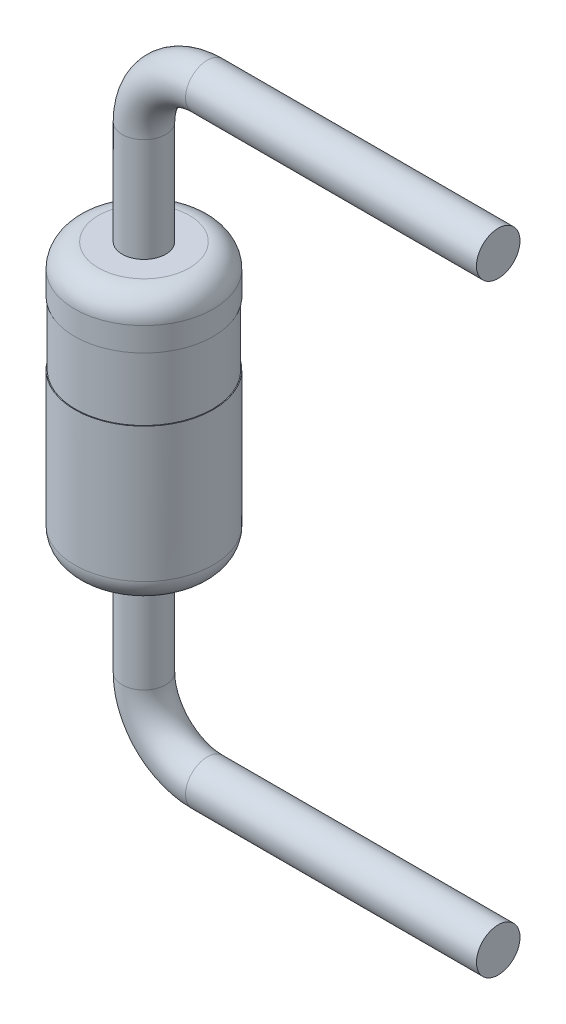
ISO-10303-21;
HEADER;
FILE_DESCRIPTION(('STEP AP214'),'2;1');
FILE_NAME('part.step','',(''),(''),'','','');
FILE_SCHEMA(('AUTOMOTIVE_DESIGN { 1 0 10303 214 1 1 1 1 }'));
ENDSEC;
DATA;
#1=APPLICATION_CONTEXT('core data for automotive mechanical design processes');
#2=APPLICATION_PROTOCOL_DEFINITION('international standard','automotive_design',2000,#1);
#3=PRODUCT_CONTEXT('',#1,'mechanical');
#4=PRODUCT('Part','Part','',(#3));
#5=PRODUCT_RELATED_PRODUCT_CATEGORY('part','',(#4));
#6=PRODUCT_DEFINITION_FORMATION('','',#4);
#7=PRODUCT_DEFINITION_CONTEXT('part definition',#1,'design');
#8=PRODUCT_DEFINITION('design','',#6,#7);
#9=PRODUCT_DEFINITION_SHAPE('','',#8);
#10=(LENGTH_UNIT() NAMED_UNIT(*) SI_UNIT(.MILLI.,.METRE.));
#11=(NAMED_UNIT(*) PLANE_ANGLE_UNIT() SI_UNIT($,.RADIAN.));
#12=(NAMED_UNIT(*) SI_UNIT($,.STERADIAN.) SOLID_ANGLE_UNIT());
#13=UNCERTAINTY_MEASURE_WITH_UNIT(LENGTH_MEASURE(1.E-05),#10,'distance_accuracy_value','');
#14=(GEOMETRIC_REPRESENTATION_CONTEXT(3) GLOBAL_UNCERTAINTY_ASSIGNED_CONTEXT((#13)) GLOBAL_UNIT_ASSIGNED_CONTEXT((#10,
#11,#12)) REPRESENTATION_CONTEXT('',''));
#15=CARTESIAN_POINT('',(0.,0.,0.));
#16=DIRECTION('',(0.,0.,1.));
#17=DIRECTION('',(1.,0.,0.));
#18=AXIS2_PLACEMENT_3D('',#15,#16,#17);
#19=CARTESIAN_POINT('',(0.,1.7,0.));
#20=DIRECTION('',(0.,1.,0.));
#21=DIRECTION('',(-1.,0.,0.));
#22=AXIS2_PLACEMENT_3D('',#19,#20,#21);
#23=CYLINDRICAL_SURFACE('',#22,0.875);
#24=CARTESIAN_POINT('',(0.,-1.4,0.));
#25=DIRECTION('',(0.,1.,0.));
#26=DIRECTION('',(-1.,0.,0.));
#27=AXIS2_PLACEMENT_3D('',#24,#25,#26);
#28=CIRCLE('',#27,0.875);
#29=CARTESIAN_POINT('',(-0.875,-1.4,0.));
#30=VERTEX_POINT('',#29);
#31=EDGE_CURVE('E45',#30,#30,#28,.T.);
#32=ORIENTED_EDGE('',*,*,#31,.T.);
#33=EDGE_LOOP('',(#32));
#34=FACE_BOUND('',#33,.T.);
#35=CARTESIAN_POINT('',(0.,0.3,0.));
#36=DIRECTION('',(0.,-1.,0.));
#37=DIRECTION('',(1.,0.,0.));
#38=AXIS2_PLACEMENT_3D('',#35,#36,#37);
#39=CIRCLE('',#38,0.875);
#40=CARTESIAN_POINT('',(0.875,0.3,0.));
#41=VERTEX_POINT('',#40);
#42=EDGE_CURVE('E129',#41,#41,#39,.T.);
#43=ORIENTED_EDGE('',*,*,#42,.T.);
#44=EDGE_LOOP('',(#43));
#45=FACE_BOUND('',#44,.T.);
#46=ADVANCED_FACE('F37',(#34,#45),#23,.T.);
#47=CARTESIAN_POINT('',(0.875,-1.7,0.));
#48=DIRECTION('',(0.,1.,0.));
#49=DIRECTION('',(1.,0.,0.));
#50=AXIS2_PLACEMENT_3D('',#47,#48,#49);
#51=PLANE('',#50);
#52=CARTESIAN_POINT('',(0.,-1.7,0.));
#53=DIRECTION('',(0.,1.,0.));
#54=DIRECTION('',(-1.,0.,0.));
#55=AXIS2_PLACEMENT_3D('',#52,#53,#54);
#56=CIRCLE('',#55,0.275);
#57=CARTESIAN_POINT('',(-0.275,-1.7,0.));
#58=VERTEX_POINT('',#57);
#59=EDGE_CURVE('E132',#58,#58,#56,.F.);
#60=ORIENTED_EDGE('',*,*,#59,.F.);
#61=EDGE_LOOP('',(#60));
#62=FACE_BOUND('',#61,.T.);
#63=CARTESIAN_POINT('',(0.,-1.7,0.));
#64=DIRECTION('',(0.,1.,0.));
#65=DIRECTION('',(-1.,0.,0.));
#66=AXIS2_PLACEMENT_3D('',#63,#64,#65);
#67=CIRCLE('',#66,0.575);
#68=CARTESIAN_POINT('',(-0.575,-1.7,0.));
#69=VERTEX_POINT('',#68);
#70=EDGE_CURVE('E11',#69,#69,#67,.F.);
#71=ORIENTED_EDGE('',*,*,#70,.T.);
#72=EDGE_LOOP('',(#71));
#73=FACE_BOUND('',#72,.T.);
#74=ADVANCED_FACE('F85',(#62,#73),#51,.F.);
#75=CARTESIAN_POINT('',(0.,-1.4,0.));
#76=DIRECTION('',(0.,1.,0.));
#77=DIRECTION('',(-1.,0.,0.));
#78=AXIS2_PLACEMENT_3D('',#75,#76,#77);
#79=TOROIDAL_SURFACE('',#78,0.575,0.3);
#80=ORIENTED_EDGE('',*,*,#70,.F.);
#81=EDGE_LOOP('',(#80));
#82=FACE_BOUND('',#81,.T.);
#83=ORIENTED_EDGE('',*,*,#31,.F.);
#84=EDGE_LOOP('',(#83));
#85=FACE_BOUND('',#84,.T.);
#86=ADVANCED_FACE('F39',(#82,#85),#79,.T.);
#87=CARTESIAN_POINT('',(4.475,-3.81,0.));
#88=DIRECTION('',(1.,0.,0.));
#89=DIRECTION('',(0.,-1.,0.));
#90=AXIS2_PLACEMENT_3D('',#87,#88,#89);
#91=PLANE('',#90);
#92=CARTESIAN_POINT('',(4.475,-3.81,0.));
#93=DIRECTION('',(-1.,0.,0.));
#94=DIRECTION('',(0.,-1.,0.));
#95=AXIS2_PLACEMENT_3D('',#92,#93,#94);
#96=CIRCLE('',#95,0.275);
#97=CARTESIAN_POINT('',(4.475,-4.085,0.));
#98=VERTEX_POINT('',#97);
#99=EDGE_CURVE('E54',#98,#98,#96,.F.);
#100=ORIENTED_EDGE('',*,*,#99,.T.);
#101=EDGE_LOOP('',(#100));
#102=FACE_BOUND('',#101,.T.);
#103=ADVANCED_FACE('F55',(#102),#91,.T.);
#104=CARTESIAN_POINT('',(0.,-1.7,0.));
#105=DIRECTION('',(0.,-1.,0.));
#106=DIRECTION('',(1.,0.,0.));
#107=AXIS2_PLACEMENT_3D('',#104,#105,#106);
#108=CYLINDRICAL_SURFACE('',#107,0.275);
#109=CARTESIAN_POINT('',(0.,-3.01,0.));
#110=DIRECTION('',(0.,1.,0.));
#111=DIRECTION('',(-1.,0.,0.));
#112=AXIS2_PLACEMENT_3D('',#109,#110,#111);
#113=CIRCLE('',#112,0.275);
#114=CARTESIAN_POINT('',(-0.275000000000002,-3.01,0.));
#115=VERTEX_POINT('',#114);
#116=EDGE_CURVE('E64',#115,#115,#113,.F.);
#117=ORIENTED_EDGE('',*,*,#116,.F.);
#118=EDGE_LOOP('',(#117));
#119=FACE_BOUND('',#118,.T.);
#120=ORIENTED_EDGE('',*,*,#59,.T.);
#121=EDGE_LOOP('',(#120));
#122=FACE_BOUND('',#121,.T.);
#123=ADVANCED_FACE('F92',(#119,#122),#108,.T.);
#124=CARTESIAN_POINT('',(0.799999999999999,-3.01,0.));
#125=DIRECTION('',(0.,0.,1.));
#126=DIRECTION('',(1.,0.,0.));
#127=AXIS2_PLACEMENT_3D('',#124,#125,#126);
#128=TOROIDAL_SURFACE('',#127,0.800000000000001,0.275);
#129=CARTESIAN_POINT('',(0.799999999999999,-3.81,0.));
#130=DIRECTION('',(-1.,0.,0.));
#131=DIRECTION('',(0.,-1.,0.));
#132=AXIS2_PLACEMENT_3D('',#129,#130,#131);
#133=CIRCLE('',#132,0.275);
#134=CARTESIAN_POINT('',(0.799999999999999,-4.085,0.));
#135=VERTEX_POINT('',#134);
#136=EDGE_CURVE('E58',#135,#135,#133,.F.);
#137=CARTESIAN_POINT('',(0.799999999999999,-3.01,0.));
#138=DIRECTION('',(0.,0.,1.));
#139=DIRECTION('',(1.,0.,0.));
#140=AXIS2_PLACEMENT_3D('',#137,#138,#139);
#141=CIRCLE('',#140,1.075);
#142=EDGE_CURVE('',#115,#135,#141,.T.);
#143=ORIENTED_EDGE('',*,*,#116,.T.);
#144=ORIENTED_EDGE('',*,*,#136,.F.);
#145=ORIENTED_EDGE('',*,*,#142,.T.);
#146=ORIENTED_EDGE('',*,*,#142,.F.);
#147=EDGE_LOOP('',(#143,#145,#144,#146));
#148=FACE_BOUND('',#147,.T.);
#149=ADVANCED_FACE('F99',(#148),#128,.T.);
#150=CARTESIAN_POINT('',(0.799999999999999,-3.81,0.));
#151=DIRECTION('',(1.,0.,0.));
#152=DIRECTION('',(0.,1.,0.));
#153=AXIS2_PLACEMENT_3D('',#150,#151,#152);
#154=CYLINDRICAL_SURFACE('',#153,0.275);
#155=ORIENTED_EDGE('',*,*,#99,.F.);
#156=EDGE_LOOP('',(#155));
#157=FACE_BOUND('',#156,.T.);
#158=ORIENTED_EDGE('',*,*,#136,.T.);
#159=EDGE_LOOP('',(#158));
#160=FACE_BOUND('',#159,.T.);
#161=ADVANCED_FACE('F87',(#157,#160),#154,.T.);
#162=CARTESIAN_POINT('',(-0.875,0.3,0.));
#163=DIRECTION('',(0.,1.,0.));
#164=DIRECTION('',(-1.,0.,0.));
#165=AXIS2_PLACEMENT_3D('',#162,#163,#164);
#166=PLANE('',#165);
#167=CARTESIAN_POINT('',(0.,0.3,0.));
#168=DIRECTION('',(0.,-1.,0.));
#169=DIRECTION('',(1.,0.,0.));
#170=AXIS2_PLACEMENT_3D('',#167,#168,#169);
#171=CIRCLE('',#170,0.865);
#172=CARTESIAN_POINT('',(0.865,0.3,0.));
#173=VERTEX_POINT('',#172);
#174=EDGE_CURVE('E124',#173,#173,#171,.T.);
#175=ORIENTED_EDGE('',*,*,#174,.T.);
#176=EDGE_LOOP('',(#175));
#177=FACE_BOUND('',#176,.T.);
#178=ORIENTED_EDGE('',*,*,#42,.F.);
#179=EDGE_LOOP('',(#178));
#180=FACE_BOUND('',#179,.T.);
#181=ADVANCED_FACE('F94',(#177,#180),#166,.T.);
#182=CARTESIAN_POINT('',(0.,-1.4,0.));
#183=DIRECTION('',(0.,-1.,0.));
#184=DIRECTION('',(1.,0.,0.));
#185=AXIS2_PLACEMENT_3D('',#182,#183,#184);
#186=CYLINDRICAL_SURFACE('',#185,0.865);
#187=CARTESIAN_POINT('',(0.,1.1,0.));
#188=DIRECTION('',(0.,-1.,0.));
#189=DIRECTION('',(1.,0.,0.));
#190=AXIS2_PLACEMENT_3D('',#187,#188,#189);
#191=CIRCLE('',#190,0.865);
#192=CARTESIAN_POINT('',(0.865,1.1,0.));
#193=VERTEX_POINT('',#192);
#194=EDGE_CURVE('E121',#193,#193,#191,.T.);
#195=ORIENTED_EDGE('',*,*,#194,.T.);
#196=EDGE_LOOP('',(#195));
#197=FACE_BOUND('',#196,.T.);
#198=ORIENTED_EDGE('',*,*,#174,.F.);
#199=EDGE_LOOP('',(#198));
#200=FACE_BOUND('',#199,.T.);
#201=ADVANCED_FACE('F187',(#197,#200),#186,.T.);
#202=CARTESIAN_POINT('',(-0.875,1.1,0.));
#203=DIRECTION('',(0.,-1.,0.));
#204=DIRECTION('',(1.,0.,0.));
#205=AXIS2_PLACEMENT_3D('',#202,#203,#204);
#206=PLANE('',#205);
#207=CARTESIAN_POINT('',(0.,1.1,0.));
#208=DIRECTION('',(0.,-1.,0.));
#209=DIRECTION('',(1.,0.,0.));
#210=AXIS2_PLACEMENT_3D('',#207,#208,#209);
#211=CIRCLE('',#210,0.875);
#212=CARTESIAN_POINT('',(0.875,1.1,0.));
#213=VERTEX_POINT('',#212);
#214=EDGE_CURVE('E119',#213,#213,#211,.T.);
#215=ORIENTED_EDGE('',*,*,#214,.T.);
#216=EDGE_LOOP('',(#215));
#217=FACE_BOUND('',#216,.T.);
#218=ORIENTED_EDGE('',*,*,#194,.F.);
#219=EDGE_LOOP('',(#218));
#220=FACE_BOUND('',#219,.T.);
#221=ADVANCED_FACE('F165',(#217,#220),#206,.T.);
#222=CARTESIAN_POINT('',(4.475,3.81,0.));
#223=DIRECTION('',(1.,0.,0.));
#224=DIRECTION('',(0.,1.,0.));
#225=AXIS2_PLACEMENT_3D('',#222,#223,#224);
#226=PLANE('',#225);
#227=CARTESIAN_POINT('',(4.475,3.81,0.));
#228=DIRECTION('',(1.,0.,0.));
#229=DIRECTION('',(0.,1.,0.));
#230=AXIS2_PLACEMENT_3D('',#227,#228,#229);
#231=CIRCLE('',#230,0.275);
#232=CARTESIAN_POINT('',(4.475,4.085,0.));
#233=VERTEX_POINT('',#232);
#234=EDGE_CURVE('E50',#233,#233,#231,.T.);
#235=ORIENTED_EDGE('',*,*,#234,.T.);
#236=EDGE_LOOP('',(#235));
#237=FACE_BOUND('',#236,.T.);
#238=ADVANCED_FACE('F162',(#237),#226,.T.);
#239=CARTESIAN_POINT('',(0.8,3.81,0.));
#240=DIRECTION('',(1.,0.,0.));
#241=DIRECTION('',(0.,1.,0.));
#242=AXIS2_PLACEMENT_3D('',#239,#240,#241);
#243=CYLINDRICAL_SURFACE('',#242,0.275);
#244=ORIENTED_EDGE('',*,*,#234,.F.);
#245=EDGE_LOOP('',(#244));
#246=FACE_BOUND('',#245,.T.);
#247=CARTESIAN_POINT('',(0.8,3.81,0.));
#248=DIRECTION('',(1.,0.,0.));
#249=DIRECTION('',(0.,1.,0.));
#250=AXIS2_PLACEMENT_3D('',#247,#248,#249);
#251=CIRCLE('',#250,0.275);
#252=CARTESIAN_POINT('',(0.8,4.085,0.));
#253=VERTEX_POINT('',#252);
#254=EDGE_CURVE('E61',#253,#253,#251,.T.);
#255=ORIENTED_EDGE('',*,*,#254,.T.);
#256=EDGE_LOOP('',(#255));
#257=FACE_BOUND('',#256,.T.);
#258=ADVANCED_FACE('F158',(#246,#257),#243,.T.);
#259=CARTESIAN_POINT('',(0.8,3.01,0.));
#260=DIRECTION('',(0.,0.,-1.));
#261=DIRECTION('',(-1.,0.,0.));
#262=AXIS2_PLACEMENT_3D('',#259,#260,#261);
#263=TOROIDAL_SURFACE('',#262,0.800000000000001,0.275);
#264=CARTESIAN_POINT('',(0.,3.01,0.));
#265=DIRECTION('',(0.,1.,0.));
#266=DIRECTION('',(-1.,0.,0.));
#267=AXIS2_PLACEMENT_3D('',#264,#265,#266);
#268=CIRCLE('',#267,0.275);
#269=CARTESIAN_POINT('',(-0.275000000000001,3.01,0.));
#270=VERTEX_POINT('',#269);
#271=EDGE_CURVE('E57',#270,#270,#268,.T.);
#272=CARTESIAN_POINT('',(0.8,3.01,0.));
#273=DIRECTION('',(0.,0.,-1.));
#274=DIRECTION('',(-1.,0.,0.));
#275=AXIS2_PLACEMENT_3D('',#272,#273,#274);
#276=CIRCLE('',#275,1.075);
#277=EDGE_CURVE('',#270,#253,#276,.T.);
#278=ORIENTED_EDGE('',*,*,#271,.T.);
#279=ORIENTED_EDGE('',*,*,#254,.F.);
#280=ORIENTED_EDGE('',*,*,#277,.T.);
#281=ORIENTED_EDGE('',*,*,#277,.F.);
#282=EDGE_LOOP('',(#278,#280,#279,#281));
#283=FACE_BOUND('',#282,.T.);
#284=ADVANCED_FACE('F154',(#283),#263,.T.);
#285=CARTESIAN_POINT('',(0.,1.7,0.));
#286=DIRECTION('',(0.,1.,0.));
#287=DIRECTION('',(-1.,0.,0.));
#288=AXIS2_PLACEMENT_3D('',#285,#286,#287);
#289=CYLINDRICAL_SURFACE('',#288,0.275);
#290=ORIENTED_EDGE('',*,*,#271,.F.);
#291=EDGE_LOOP('',(#290));
#292=FACE_BOUND('',#291,.T.);
#293=CARTESIAN_POINT('',(0.,1.7,0.));
#294=DIRECTION('',(0.,1.,0.));
#295=DIRECTION('',(-1.,0.,0.));
#296=AXIS2_PLACEMENT_3D('',#293,#294,#295);
#297=CIRCLE('',#296,0.275);
#298=CARTESIAN_POINT('',(-0.275,1.7,0.));
#299=VERTEX_POINT('',#298);
#300=EDGE_CURVE('E68',#299,#299,#297,.T.);
#301=ORIENTED_EDGE('',*,*,#300,.T.);
#302=EDGE_LOOP('',(#301));
#303=FACE_BOUND('',#302,.T.);
#304=ADVANCED_FACE('F151',(#292,#303),#289,.T.);
#305=CARTESIAN_POINT('',(0.875,1.7,0.));
#306=DIRECTION('',(0.,-1.,0.));
#307=DIRECTION('',(1.,0.,0.));
#308=AXIS2_PLACEMENT_3D('',#305,#306,#307);
#309=PLANE('',#308);
#310=ORIENTED_EDGE('',*,*,#300,.F.);
#311=EDGE_LOOP('',(#310));
#312=FACE_BOUND('',#311,.T.);
#313=CARTESIAN_POINT('',(0.,1.7,0.));
#314=DIRECTION('',(0.,-1.,0.));
#315=DIRECTION('',(1.,0.,0.));
#316=AXIS2_PLACEMENT_3D('',#313,#314,#315);
#317=CIRCLE('',#316,0.575);
#318=CARTESIAN_POINT('',(0.575,1.7,0.));
#319=VERTEX_POINT('',#318);
#320=EDGE_CURVE('E75',#319,#319,#317,.F.);
#321=ORIENTED_EDGE('',*,*,#320,.T.);
#322=EDGE_LOOP('',(#321));
#323=FACE_BOUND('',#322,.T.);
#324=ADVANCED_FACE('F113',(#312,#323),#309,.F.);
#325=CARTESIAN_POINT('',(0.,1.4,0.));
#326=DIRECTION('',(0.,-1.,0.));
#327=DIRECTION('',(1.,0.,0.));
#328=AXIS2_PLACEMENT_3D('',#325,#326,#327);
#329=TOROIDAL_SURFACE('',#328,0.575,0.3);
#330=CARTESIAN_POINT('',(0.,1.4,0.));
#331=DIRECTION('',(0.,-1.,0.));
#332=DIRECTION('',(1.,0.,0.));
#333=AXIS2_PLACEMENT_3D('',#330,#331,#332);
#334=CIRCLE('',#333,0.875);
#335=CARTESIAN_POINT('',(0.875,1.4,0.));
#336=VERTEX_POINT('',#335);
#337=EDGE_CURVE('E70',#336,#336,#334,.T.);
#338=ORIENTED_EDGE('',*,*,#337,.F.);
#339=EDGE_LOOP('',(#338));
#340=FACE_BOUND('',#339,.T.);
#341=ORIENTED_EDGE('',*,*,#320,.F.);
#342=EDGE_LOOP('',(#341));
#343=FACE_BOUND('',#342,.T.);
#344=ADVANCED_FACE('F108',(#340,#343),#329,.T.);
#345=ORIENTED_EDGE('',*,*,#337,.T.);
#346=EDGE_LOOP('',(#345));
#347=FACE_BOUND('',#346,.T.);
#348=ORIENTED_EDGE('',*,*,#214,.F.);
#349=EDGE_LOOP('',(#348));
#350=FACE_BOUND('',#349,.T.);
#351=ADVANCED_FACE('F103',(#347,#350),#23,.T.);
#352=CLOSED_SHELL('',(#46,#74,#86,#103,#123,#149,#161,#181,#201,#221,#238,#258,#284,#304,#324,
#344,#351));
#353=MANIFOLD_SOLID_BREP('B2',#352);
#354=ADVANCED_BREP_SHAPE_REPRESENTATION('',(#18,#353),#14);
#355=SHAPE_DEFINITION_REPRESENTATION(#9,#354);
ENDSEC;
END-ISO-10303-21;
